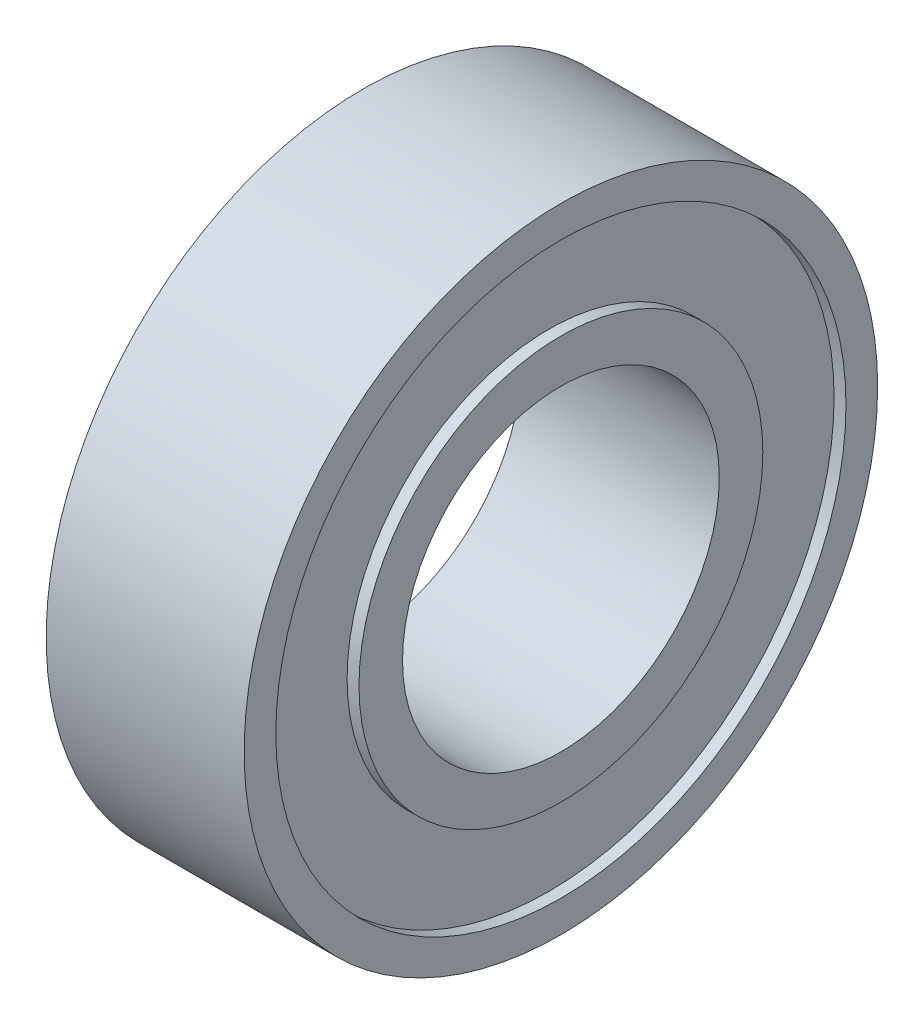
ISO-10303-21;
HEADER;
FILE_DESCRIPTION(('STEP AP214'),'2;1');
FILE_NAME('part.step','',(''),(''),'','','');
FILE_SCHEMA(('AUTOMOTIVE_DESIGN { 1 0 10303 214 1 1 1 1 }'));
ENDSEC;
DATA;
#1=APPLICATION_CONTEXT('core data for automotive mechanical design processes');
#2=APPLICATION_PROTOCOL_DEFINITION('international standard','automotive_design',2000,#1);
#3=PRODUCT_CONTEXT('',#1,'mechanical');
#4=PRODUCT('Part','Part','',(#3));
#5=PRODUCT_RELATED_PRODUCT_CATEGORY('part','',(#4));
#6=PRODUCT_DEFINITION_FORMATION('','',#4);
#7=PRODUCT_DEFINITION_CONTEXT('part definition',#1,'design');
#8=PRODUCT_DEFINITION('design','',#6,#7);
#9=PRODUCT_DEFINITION_SHAPE('','',#8);
#10=(LENGTH_UNIT() NAMED_UNIT(*) SI_UNIT(.MILLI.,.METRE.));
#11=(NAMED_UNIT(*) PLANE_ANGLE_UNIT() SI_UNIT($,.RADIAN.));
#12=(NAMED_UNIT(*) SI_UNIT($,.STERADIAN.) SOLID_ANGLE_UNIT());
#13=UNCERTAINTY_MEASURE_WITH_UNIT(LENGTH_MEASURE(1.E-05),#10,'distance_accuracy_value','');
#14=(GEOMETRIC_REPRESENTATION_CONTEXT(3) GLOBAL_UNCERTAINTY_ASSIGNED_CONTEXT((#13)) GLOBAL_UNIT_ASSIGNED_CONTEXT((#10,
#11,#12)) REPRESENTATION_CONTEXT('',''));
#15=CARTESIAN_POINT('',(0.,0.,0.));
#16=DIRECTION('',(0.,0.,1.));
#17=DIRECTION('',(1.,0.,0.));
#18=AXIS2_PLACEMENT_3D('',#15,#16,#17);
#19=CARTESIAN_POINT('',(-2.5,4.,0.));
#20=DIRECTION('',(-1.,0.,0.));
#21=DIRECTION('',(0.,0.,1.));
#22=AXIS2_PLACEMENT_3D('',#19,#20,#21);
#23=PLANE('',#22);
#24=CARTESIAN_POINT('',(-2.5,0.,0.));
#25=DIRECTION('',(1.,0.,0.));
#26=DIRECTION('',(0.,0.,-1.));
#27=AXIS2_PLACEMENT_3D('',#24,#25,#26);
#28=CIRCLE('',#27,4.);
#29=CARTESIAN_POINT('',(-2.5,0.,-4.));
#30=VERTEX_POINT('',#29);
#31=EDGE_CURVE('E74',#30,#30,#28,.T.);
#32=ORIENTED_EDGE('',*,*,#31,.T.);
#33=EDGE_LOOP('',(#32));
#34=FACE_BOUND('',#33,.T.);
#35=CARTESIAN_POINT('',(-2.5,0.,0.));
#36=DIRECTION('',(1.,0.,0.));
#37=DIRECTION('',(0.,0.,-1.));
#38=AXIS2_PLACEMENT_3D('',#35,#36,#37);
#39=CIRCLE('',#38,5.1);
#40=CARTESIAN_POINT('',(-2.5,0.,-5.1));
#41=VERTEX_POINT('',#40);
#42=EDGE_CURVE('E10',#41,#41,#39,.T.);
#43=ORIENTED_EDGE('',*,*,#42,.F.);
#44=EDGE_LOOP('',(#43));
#45=FACE_BOUND('',#44,.T.);
#46=ADVANCED_FACE('F34',(#34,#45),#23,.T.);
#47=CARTESIAN_POINT('',(0.,0.,0.));
#48=DIRECTION('',(1.,0.,0.));
#49=DIRECTION('',(0.,0.,-1.));
#50=AXIS2_PLACEMENT_3D('',#47,#48,#49);
#51=CYLINDRICAL_SURFACE('',#50,5.1);
#52=ORIENTED_EDGE('',*,*,#42,.T.);
#53=EDGE_LOOP('',(#52));
#54=FACE_BOUND('',#53,.T.);
#55=CARTESIAN_POINT('',(-2.2,0.,0.));
#56=DIRECTION('',(1.,0.,0.));
#57=DIRECTION('',(0.,0.,-1.));
#58=AXIS2_PLACEMENT_3D('',#55,#56,#57);
#59=CIRCLE('',#58,5.1);
#60=CARTESIAN_POINT('',(-2.2,0.,-5.1));
#61=VERTEX_POINT('',#60);
#62=EDGE_CURVE('E40',#61,#61,#59,.T.);
#63=ORIENTED_EDGE('',*,*,#62,.F.);
#64=EDGE_LOOP('',(#63));
#65=FACE_BOUND('',#64,.T.);
#66=ADVANCED_FACE('F92',(#54,#65),#51,.T.);
#67=CARTESIAN_POINT('',(-2.2,5.1,0.));
#68=DIRECTION('',(-1.,0.,0.));
#69=DIRECTION('',(0.,0.,1.));
#70=AXIS2_PLACEMENT_3D('',#67,#68,#69);
#71=PLANE('',#70);
#72=ORIENTED_EDGE('',*,*,#62,.T.);
#73=EDGE_LOOP('',(#72));
#74=FACE_BOUND('',#73,.T.);
#75=CARTESIAN_POINT('',(-2.2,0.,0.));
#76=DIRECTION('',(1.,0.,0.));
#77=DIRECTION('',(0.,0.,-1.));
#78=AXIS2_PLACEMENT_3D('',#75,#76,#77);
#79=CIRCLE('',#78,7.2);
#80=CARTESIAN_POINT('',(-2.2,0.,-7.2));
#81=VERTEX_POINT('',#80);
#82=EDGE_CURVE('E44',#81,#81,#79,.T.);
#83=ORIENTED_EDGE('',*,*,#82,.F.);
#84=EDGE_LOOP('',(#83));
#85=FACE_BOUND('',#84,.T.);
#86=ADVANCED_FACE('F96',(#74,#85),#71,.T.);
#87=CARTESIAN_POINT('',(0.,0.,0.));
#88=DIRECTION('',(1.,0.,0.));
#89=DIRECTION('',(0.,0.,-1.));
#90=AXIS2_PLACEMENT_3D('',#87,#88,#89);
#91=CYLINDRICAL_SURFACE('',#90,7.2);
#92=ORIENTED_EDGE('',*,*,#82,.T.);
#93=EDGE_LOOP('',(#92));
#94=FACE_BOUND('',#93,.T.);
#95=CARTESIAN_POINT('',(-2.5,0.,0.));
#96=DIRECTION('',(1.,0.,0.));
#97=DIRECTION('',(0.,0.,-1.));
#98=AXIS2_PLACEMENT_3D('',#95,#96,#97);
#99=CIRCLE('',#98,7.2);
#100=CARTESIAN_POINT('',(-2.5,0.,-7.2));
#101=VERTEX_POINT('',#100);
#102=EDGE_CURVE('E48',#101,#101,#99,.T.);
#103=ORIENTED_EDGE('',*,*,#102,.F.);
#104=EDGE_LOOP('',(#103));
#105=FACE_BOUND('',#104,.T.);
#106=ADVANCED_FACE('F100',(#94,#105),#91,.F.);
#107=CARTESIAN_POINT('',(-2.5,7.2,0.));
#108=DIRECTION('',(-1.,0.,0.));
#109=DIRECTION('',(0.,0.,1.));
#110=AXIS2_PLACEMENT_3D('',#107,#108,#109);
#111=PLANE('',#110);
#112=ORIENTED_EDGE('',*,*,#102,.T.);
#113=EDGE_LOOP('',(#112));
#114=FACE_BOUND('',#113,.T.);
#115=CARTESIAN_POINT('',(-2.5,0.,0.));
#116=DIRECTION('',(1.,0.,0.));
#117=DIRECTION('',(0.,0.,-1.));
#118=AXIS2_PLACEMENT_3D('',#115,#116,#117);
#119=CIRCLE('',#118,8.);
#120=CARTESIAN_POINT('',(-2.5,0.,-8.));
#121=VERTEX_POINT('',#120);
#122=EDGE_CURVE('E53',#121,#121,#119,.T.);
#123=ORIENTED_EDGE('',*,*,#122,.F.);
#124=EDGE_LOOP('',(#123));
#125=FACE_BOUND('',#124,.T.);
#126=ADVANCED_FACE('F106',(#114,#125),#111,.T.);
#127=CARTESIAN_POINT('',(0.,0.,0.));
#128=DIRECTION('',(1.,0.,0.));
#129=DIRECTION('',(0.,0.,-1.));
#130=AXIS2_PLACEMENT_3D('',#127,#128,#129);
#131=CYLINDRICAL_SURFACE('',#130,8.);
#132=ORIENTED_EDGE('',*,*,#122,.T.);
#133=EDGE_LOOP('',(#132));
#134=FACE_BOUND('',#133,.T.);
#135=CARTESIAN_POINT('',(2.5,0.,0.));
#136=DIRECTION('',(1.,0.,0.));
#137=DIRECTION('',(0.,0.,-1.));
#138=AXIS2_PLACEMENT_3D('',#135,#136,#137);
#139=CIRCLE('',#138,8.);
#140=CARTESIAN_POINT('',(2.5,0.,-8.));
#141=VERTEX_POINT('',#140);
#142=EDGE_CURVE('E56',#141,#141,#139,.T.);
#143=ORIENTED_EDGE('',*,*,#142,.F.);
#144=EDGE_LOOP('',(#143));
#145=FACE_BOUND('',#144,.T.);
#146=ADVANCED_FACE('F110',(#134,#145),#131,.T.);
#147=CARTESIAN_POINT('',(2.5,7.2,0.));
#148=DIRECTION('',(1.,0.,0.));
#149=DIRECTION('',(0.,0.,-1.));
#150=AXIS2_PLACEMENT_3D('',#147,#148,#149);
#151=PLANE('',#150);
#152=ORIENTED_EDGE('',*,*,#142,.T.);
#153=EDGE_LOOP('',(#152));
#154=FACE_BOUND('',#153,.T.);
#155=CARTESIAN_POINT('',(2.5,0.,0.));
#156=DIRECTION('',(1.,0.,0.));
#157=DIRECTION('',(0.,0.,-1.));
#158=AXIS2_PLACEMENT_3D('',#155,#156,#157);
#159=CIRCLE('',#158,7.2);
#160=CARTESIAN_POINT('',(2.5,0.,-7.2));
#161=VERTEX_POINT('',#160);
#162=EDGE_CURVE('E59',#161,#161,#159,.T.);
#163=ORIENTED_EDGE('',*,*,#162,.F.);
#164=EDGE_LOOP('',(#163));
#165=FACE_BOUND('',#164,.T.);
#166=ADVANCED_FACE('F114',(#154,#165),#151,.T.);
#167=CARTESIAN_POINT('',(0.,0.,0.));
#168=DIRECTION('',(1.,0.,0.));
#169=DIRECTION('',(0.,0.,-1.));
#170=AXIS2_PLACEMENT_3D('',#167,#168,#169);
#171=CYLINDRICAL_SURFACE('',#170,7.2);
#172=ORIENTED_EDGE('',*,*,#162,.T.);
#173=EDGE_LOOP('',(#172));
#174=FACE_BOUND('',#173,.T.);
#175=CARTESIAN_POINT('',(2.2,0.,0.));
#176=DIRECTION('',(1.,0.,0.));
#177=DIRECTION('',(0.,0.,-1.));
#178=AXIS2_PLACEMENT_3D('',#175,#176,#177);
#179=CIRCLE('',#178,7.2);
#180=CARTESIAN_POINT('',(2.2,0.,-7.2));
#181=VERTEX_POINT('',#180);
#182=EDGE_CURVE('E62',#181,#181,#179,.T.);
#183=ORIENTED_EDGE('',*,*,#182,.F.);
#184=EDGE_LOOP('',(#183));
#185=FACE_BOUND('',#184,.T.);
#186=ADVANCED_FACE('F118',(#174,#185),#171,.F.);
#187=CARTESIAN_POINT('',(2.2,5.1,0.));
#188=DIRECTION('',(1.,0.,0.));
#189=DIRECTION('',(0.,0.,-1.));
#190=AXIS2_PLACEMENT_3D('',#187,#188,#189);
#191=PLANE('',#190);
#192=ORIENTED_EDGE('',*,*,#182,.T.);
#193=EDGE_LOOP('',(#192));
#194=FACE_BOUND('',#193,.T.);
#195=CARTESIAN_POINT('',(2.2,0.,0.));
#196=DIRECTION('',(1.,0.,0.));
#197=DIRECTION('',(0.,0.,-1.));
#198=AXIS2_PLACEMENT_3D('',#195,#196,#197);
#199=CIRCLE('',#198,5.1);
#200=CARTESIAN_POINT('',(2.2,0.,-5.1));
#201=VERTEX_POINT('',#200);
#202=EDGE_CURVE('E65',#201,#201,#199,.T.);
#203=ORIENTED_EDGE('',*,*,#202,.F.);
#204=EDGE_LOOP('',(#203));
#205=FACE_BOUND('',#204,.T.);
#206=ADVANCED_FACE('F122',(#194,#205),#191,.T.);
#207=CARTESIAN_POINT('',(0.,0.,0.));
#208=DIRECTION('',(1.,0.,0.));
#209=DIRECTION('',(0.,0.,-1.));
#210=AXIS2_PLACEMENT_3D('',#207,#208,#209);
#211=CYLINDRICAL_SURFACE('',#210,5.1);
#212=ORIENTED_EDGE('',*,*,#202,.T.);
#213=EDGE_LOOP('',(#212));
#214=FACE_BOUND('',#213,.T.);
#215=CARTESIAN_POINT('',(2.5,0.,0.));
#216=DIRECTION('',(1.,0.,0.));
#217=DIRECTION('',(0.,0.,-1.));
#218=AXIS2_PLACEMENT_3D('',#215,#216,#217);
#219=CIRCLE('',#218,5.1);
#220=CARTESIAN_POINT('',(2.5,0.,-5.1));
#221=VERTEX_POINT('',#220);
#222=EDGE_CURVE('E68',#221,#221,#219,.T.);
#223=ORIENTED_EDGE('',*,*,#222,.F.);
#224=EDGE_LOOP('',(#223));
#225=FACE_BOUND('',#224,.T.);
#226=ADVANCED_FACE('F88',(#214,#225),#211,.T.);
#227=CARTESIAN_POINT('',(2.5,4.,0.));
#228=DIRECTION('',(1.,0.,0.));
#229=DIRECTION('',(0.,0.,-1.));
#230=AXIS2_PLACEMENT_3D('',#227,#228,#229);
#231=PLANE('',#230);
#232=ORIENTED_EDGE('',*,*,#222,.T.);
#233=EDGE_LOOP('',(#232));
#234=FACE_BOUND('',#233,.T.);
#235=CARTESIAN_POINT('',(2.5,0.,0.));
#236=DIRECTION('',(1.,0.,0.));
#237=DIRECTION('',(0.,0.,-1.));
#238=AXIS2_PLACEMENT_3D('',#235,#236,#237);
#239=CIRCLE('',#238,4.);
#240=CARTESIAN_POINT('',(2.5,0.,-4.));
#241=VERTEX_POINT('',#240);
#242=EDGE_CURVE('E71',#241,#241,#239,.T.);
#243=ORIENTED_EDGE('',*,*,#242,.F.);
#244=EDGE_LOOP('',(#243));
#245=FACE_BOUND('',#244,.T.);
#246=ADVANCED_FACE('F82',(#234,#245),#231,.T.);
#247=CARTESIAN_POINT('',(0.,0.,0.));
#248=DIRECTION('',(1.,0.,0.));
#249=DIRECTION('',(0.,0.,-1.));
#250=AXIS2_PLACEMENT_3D('',#247,#248,#249);
#251=CYLINDRICAL_SURFACE('',#250,4.);
#252=ORIENTED_EDGE('',*,*,#242,.T.);
#253=EDGE_LOOP('',(#252));
#254=FACE_BOUND('',#253,.T.);
#255=ORIENTED_EDGE('',*,*,#31,.F.);
#256=EDGE_LOOP('',(#255));
#257=FACE_BOUND('',#256,.T.);
#258=ADVANCED_FACE('F80',(#254,#257),#251,.F.);
#259=CLOSED_SHELL('',(#46,#66,#86,#106,#126,#146,#166,#186,#206,#226,#246,#258));
#260=MANIFOLD_SOLID_BREP('B2',#259);
#261=ADVANCED_BREP_SHAPE_REPRESENTATION('',(#18,#260),#14);
#262=SHAPE_DEFINITION_REPRESENTATION(#9,#261);
ENDSEC;
END-ISO-10303-21;
